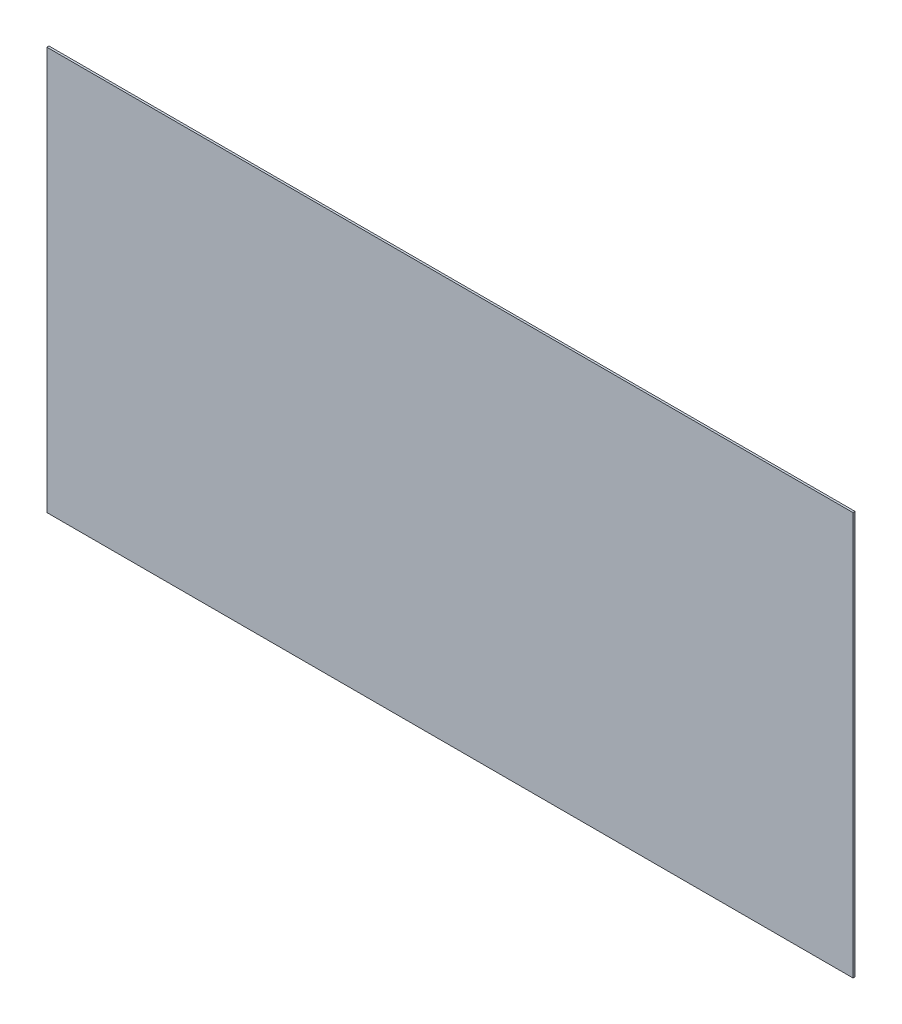
ISO-10303-21;
HEADER;
FILE_DESCRIPTION(('STEP AP214'),'2;1');
FILE_NAME('part.step','',(''),(''),'','','');
FILE_SCHEMA(('AUTOMOTIVE_DESIGN { 1 0 10303 214 1 1 1 1 }'));
ENDSEC;
DATA;
#1=APPLICATION_CONTEXT('core data for automotive mechanical design processes');
#2=APPLICATION_PROTOCOL_DEFINITION('international standard','automotive_design',2000,#1);
#3=PRODUCT_CONTEXT('',#1,'mechanical');
#4=PRODUCT('Part','Part','',(#3));
#5=PRODUCT_RELATED_PRODUCT_CATEGORY('part','',(#4));
#6=PRODUCT_DEFINITION_FORMATION('','',#4);
#7=PRODUCT_DEFINITION_CONTEXT('part definition',#1,'design');
#8=PRODUCT_DEFINITION('design','',#6,#7);
#9=PRODUCT_DEFINITION_SHAPE('','',#8);
#10=(LENGTH_UNIT() NAMED_UNIT(*) SI_UNIT(.MILLI.,.METRE.));
#11=(NAMED_UNIT(*) PLANE_ANGLE_UNIT() SI_UNIT($,.RADIAN.));
#12=(NAMED_UNIT(*) SI_UNIT($,.STERADIAN.) SOLID_ANGLE_UNIT());
#13=UNCERTAINTY_MEASURE_WITH_UNIT(LENGTH_MEASURE(1.E-05),#10,'distance_accuracy_value','');
#14=(GEOMETRIC_REPRESENTATION_CONTEXT(3) GLOBAL_UNCERTAINTY_ASSIGNED_CONTEXT((#13)) GLOBAL_UNIT_ASSIGNED_CONTEXT((#10,
#11,#12)) REPRESENTATION_CONTEXT('',''));
#15=CARTESIAN_POINT('',(0.,0.,0.));
#16=DIRECTION('',(0.,0.,1.));
#17=DIRECTION('',(1.,0.,0.));
#18=AXIS2_PLACEMENT_3D('',#15,#16,#17);
#19=CARTESIAN_POINT('',(0.,0.,4.7625));
#20=DIRECTION('',(0.,0.,1.));
#21=DIRECTION('',(1.,0.,0.));
#22=AXIS2_PLACEMENT_3D('',#19,#20,#21);
#23=PLANE('',#22);
#24=DIRECTION('',(1.,0.,0.));
#25=VECTOR('',#24,1.);
#26=CARTESIAN_POINT('',(914.4,914.4,4.7625));
#27=LINE('',#26,#25);
#28=CARTESIAN_POINT('',(-914.4,914.4,4.7625));
#29=VERTEX_POINT('',#28);
#30=CARTESIAN_POINT('',(914.4,914.4,4.7625));
#31=VERTEX_POINT('',#30);
#32=EDGE_CURVE('E67',#29,#31,#27,.T.);
#33=ORIENTED_EDGE('',*,*,#32,.F.);
#34=DIRECTION('',(0.,1.,0.));
#35=VECTOR('',#34,1.);
#36=CARTESIAN_POINT('',(-914.4,914.4,4.7625));
#37=LINE('',#36,#35);
#38=CARTESIAN_POINT('',(-914.4,0.,4.7625));
#39=VERTEX_POINT('',#38);
#40=EDGE_CURVE('E19',#39,#29,#37,.T.);
#41=ORIENTED_EDGE('',*,*,#40,.F.);
#42=DIRECTION('',(1.,0.,0.));
#43=VECTOR('',#42,1.);
#44=CARTESIAN_POINT('',(-914.4,0.,4.7625));
#45=LINE('',#44,#43);
#46=CARTESIAN_POINT('',(914.4,0.,4.7625));
#47=VERTEX_POINT('',#46);
#48=EDGE_CURVE('E57',#47,#39,#45,.F.);
#49=ORIENTED_EDGE('',*,*,#48,.F.);
#50=DIRECTION('',(0.,1.,0.));
#51=VECTOR('',#50,1.);
#52=CARTESIAN_POINT('',(914.4,0.,4.7625));
#53=LINE('',#52,#51);
#54=EDGE_CURVE('E52',#31,#47,#53,.F.);
#55=ORIENTED_EDGE('',*,*,#54,.F.);
#56=EDGE_LOOP('',(#33,#41,#49,#55));
#57=FACE_BOUND('',#56,.T.);
#58=ADVANCED_FACE('F16',(#57),#23,.T.);
#59=CARTESIAN_POINT('',(-914.4,914.4,0.));
#60=DIRECTION('',(-1.,0.,0.));
#61=DIRECTION('',(0.,0.,1.));
#62=AXIS2_PLACEMENT_3D('',#59,#60,#61);
#63=PLANE('',#62);
#64=DIRECTION('',(0.,0.,1.));
#65=VECTOR('',#64,1.);
#66=CARTESIAN_POINT('',(-914.4,914.4,0.));
#67=LINE('',#66,#65);
#68=CARTESIAN_POINT('',(-914.4,914.4,0.));
#69=VERTEX_POINT('',#68);
#70=EDGE_CURVE('E78',#69,#29,#67,.T.);
#71=ORIENTED_EDGE('',*,*,#70,.F.);
#72=DIRECTION('',(0.,1.,0.));
#73=VECTOR('',#72,1.);
#74=CARTESIAN_POINT('',(-914.4,0.,0.));
#75=LINE('',#74,#73);
#76=CARTESIAN_POINT('',(-914.4,0.,0.));
#77=VERTEX_POINT('',#76);
#78=EDGE_CURVE('E73',#69,#77,#75,.F.);
#79=ORIENTED_EDGE('',*,*,#78,.T.);
#80=DIRECTION('',(0.,0.,-1.));
#81=VECTOR('',#80,1.);
#82=CARTESIAN_POINT('',(-914.4,0.,0.));
#83=LINE('',#82,#81);
#84=EDGE_CURVE('E62',#39,#77,#83,.T.);
#85=ORIENTED_EDGE('',*,*,#84,.F.);
#86=ORIENTED_EDGE('',*,*,#40,.T.);
#87=EDGE_LOOP('',(#71,#79,#85,#86));
#88=FACE_BOUND('',#87,.T.);
#89=ADVANCED_FACE('F72',(#88),#63,.T.);
#90=CARTESIAN_POINT('',(-914.4,0.,0.));
#91=DIRECTION('',(0.,-1.,0.));
#92=DIRECTION('',(0.,0.,-1.));
#93=AXIS2_PLACEMENT_3D('',#90,#91,#92);
#94=PLANE('',#93);
#95=ORIENTED_EDGE('',*,*,#84,.T.);
#96=DIRECTION('',(1.,0.,0.));
#97=VECTOR('',#96,1.);
#98=CARTESIAN_POINT('',(0.,0.,0.));
#99=LINE('',#98,#97);
#100=CARTESIAN_POINT('',(914.4,0.,0.));
#101=VERTEX_POINT('',#100);
#102=EDGE_CURVE('E83',#77,#101,#99,.T.);
#103=ORIENTED_EDGE('',*,*,#102,.T.);
#104=DIRECTION('',(0.,0.,-1.));
#105=VECTOR('',#104,1.);
#106=CARTESIAN_POINT('',(914.4,0.,0.));
#107=LINE('',#106,#105);
#108=EDGE_CURVE('E64',#47,#101,#107,.T.);
#109=ORIENTED_EDGE('',*,*,#108,.F.);
#110=ORIENTED_EDGE('',*,*,#48,.T.);
#111=EDGE_LOOP('',(#95,#103,#109,#110));
#112=FACE_BOUND('',#111,.T.);
#113=ADVANCED_FACE('F59',(#112),#94,.T.);
#114=CARTESIAN_POINT('',(914.4,0.,0.));
#115=DIRECTION('',(1.,0.,0.));
#116=DIRECTION('',(0.,0.,-1.));
#117=AXIS2_PLACEMENT_3D('',#114,#115,#116);
#118=PLANE('',#117);
#119=ORIENTED_EDGE('',*,*,#108,.T.);
#120=DIRECTION('',(0.,1.,0.));
#121=VECTOR('',#120,1.);
#122=CARTESIAN_POINT('',(914.4,0.,0.));
#123=LINE('',#122,#121);
#124=CARTESIAN_POINT('',(914.4,914.4,0.));
#125=VERTEX_POINT('',#124);
#126=EDGE_CURVE('E25',#101,#125,#123,.T.);
#127=ORIENTED_EDGE('',*,*,#126,.T.);
#128=DIRECTION('',(0.,0.,1.));
#129=VECTOR('',#128,1.);
#130=CARTESIAN_POINT('',(914.4,914.4,0.));
#131=LINE('',#130,#129);
#132=EDGE_CURVE('E33',#31,#125,#131,.F.);
#133=ORIENTED_EDGE('',*,*,#132,.F.);
#134=ORIENTED_EDGE('',*,*,#54,.T.);
#135=EDGE_LOOP('',(#119,#127,#133,#134));
#136=FACE_BOUND('',#135,.T.);
#137=ADVANCED_FACE('F87',(#136),#118,.T.);
#138=CARTESIAN_POINT('',(914.4,914.4,0.));
#139=DIRECTION('',(0.,1.,0.));
#140=DIRECTION('',(0.,0.,1.));
#141=AXIS2_PLACEMENT_3D('',#138,#139,#140);
#142=PLANE('',#141);
#143=ORIENTED_EDGE('',*,*,#132,.T.);
#144=DIRECTION('',(1.,0.,0.));
#145=VECTOR('',#144,1.);
#146=CARTESIAN_POINT('',(0.,914.4,0.));
#147=LINE('',#146,#145);
#148=EDGE_CURVE('E11',#125,#69,#147,.F.);
#149=ORIENTED_EDGE('',*,*,#148,.T.);
#150=ORIENTED_EDGE('',*,*,#70,.T.);
#151=ORIENTED_EDGE('',*,*,#32,.T.);
#152=EDGE_LOOP('',(#143,#149,#150,#151));
#153=FACE_BOUND('',#152,.T.);
#154=ADVANCED_FACE('F90',(#153),#142,.T.);
#155=CARTESIAN_POINT('',(0.,0.,0.));
#156=DIRECTION('',(0.,0.,1.));
#157=DIRECTION('',(1.,0.,0.));
#158=AXIS2_PLACEMENT_3D('',#155,#156,#157);
#159=PLANE('',#158);
#160=ORIENTED_EDGE('',*,*,#126,.F.);
#161=ORIENTED_EDGE('',*,*,#102,.F.);
#162=ORIENTED_EDGE('',*,*,#78,.F.);
#163=ORIENTED_EDGE('',*,*,#148,.F.);
#164=EDGE_LOOP('',(#160,#161,#162,#163));
#165=FACE_BOUND('',#164,.T.);
#166=ADVANCED_FACE('F89',(#165),#159,.F.);
#167=CLOSED_SHELL('',(#58,#89,#113,#137,#154,#166));
#168=MANIFOLD_SOLID_BREP('B1',#167);
#169=ADVANCED_BREP_SHAPE_REPRESENTATION('',(#18,#168),#14);
#170=SHAPE_DEFINITION_REPRESENTATION(#9,#169);
ENDSEC;
END-ISO-10303-21;
